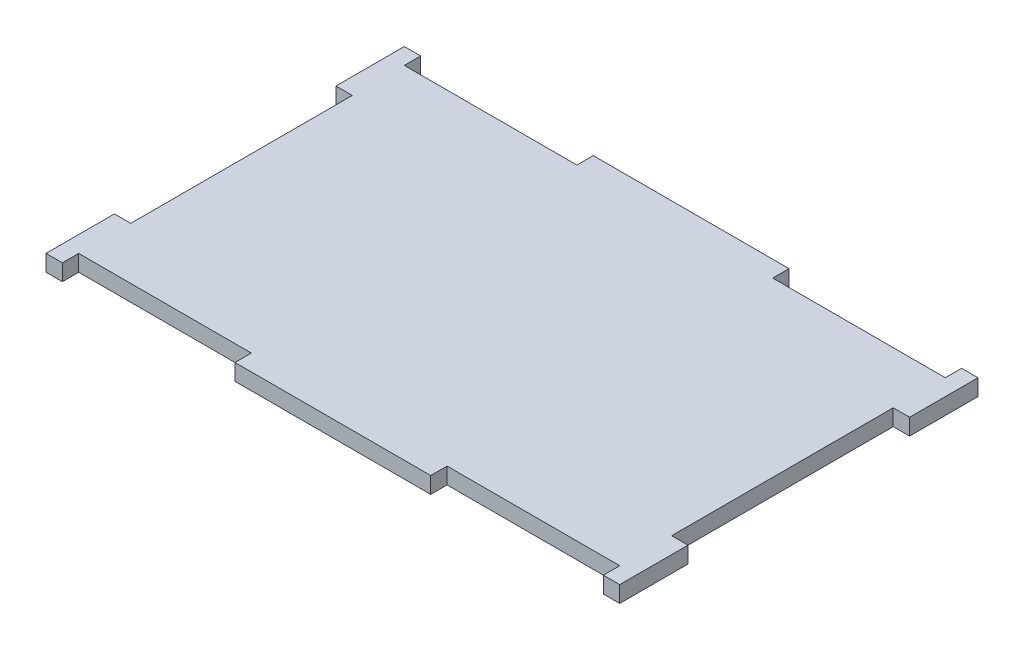
ISO-10303-21;
HEADER;
FILE_DESCRIPTION(('STEP AP214'),'2;1');
FILE_NAME('part.step','',(''),(''),'','','');
FILE_SCHEMA(('AUTOMOTIVE_DESIGN { 1 0 10303 214 1 1 1 1 }'));
ENDSEC;
DATA;
#1=APPLICATION_CONTEXT('core data for automotive mechanical design processes');
#2=APPLICATION_PROTOCOL_DEFINITION('international standard','automotive_design',2000,#1);
#3=PRODUCT_CONTEXT('',#1,'mechanical');
#4=PRODUCT('Part','Part','',(#3));
#5=PRODUCT_RELATED_PRODUCT_CATEGORY('part','',(#4));
#6=PRODUCT_DEFINITION_FORMATION('','',#4);
#7=PRODUCT_DEFINITION_CONTEXT('part definition',#1,'design');
#8=PRODUCT_DEFINITION('design','',#6,#7);
#9=PRODUCT_DEFINITION_SHAPE('','',#8);
#10=(LENGTH_UNIT() NAMED_UNIT(*) SI_UNIT(.MILLI.,.METRE.));
#11=(NAMED_UNIT(*) PLANE_ANGLE_UNIT() SI_UNIT($,.RADIAN.));
#12=(NAMED_UNIT(*) SI_UNIT($,.STERADIAN.) SOLID_ANGLE_UNIT());
#13=UNCERTAINTY_MEASURE_WITH_UNIT(LENGTH_MEASURE(1.E-05),#10,'distance_accuracy_value','');
#14=(GEOMETRIC_REPRESENTATION_CONTEXT(3) GLOBAL_UNCERTAINTY_ASSIGNED_CONTEXT((#13)) GLOBAL_UNIT_ASSIGNED_CONTEXT((#10,
#11,#12)) REPRESENTATION_CONTEXT('',''));
#15=CARTESIAN_POINT('',(0.,0.,0.));
#16=DIRECTION('',(0.,0.,1.));
#17=DIRECTION('',(1.,0.,0.));
#18=AXIS2_PLACEMENT_3D('',#15,#16,#17);
#19=CARTESIAN_POINT('',(0.,3.175,-3.175));
#20=DIRECTION('',(0.,0.,1.));
#21=DIRECTION('',(1.,0.,0.));
#22=AXIS2_PLACEMENT_3D('',#19,#20,#21);
#23=PLANE('',#22);
#24=DIRECTION('',(-1.,0.,0.));
#25=VECTOR('',#24,1.);
#26=CARTESIAN_POINT('',(0.,0.,-3.175));
#27=LINE('',#26,#25);
#28=CARTESIAN_POINT('',(108.175,0.,-3.17499999999998));
#29=VERTEX_POINT('',#28);
#30=CARTESIAN_POINT('',(74.675,0.,-3.175));
#31=VERTEX_POINT('',#30);
#32=EDGE_CURVE('E259',#29,#31,#27,.T.);
#33=ORIENTED_EDGE('',*,*,#32,.F.);
#34=DIRECTION('',(0.,-1.,0.));
#35=VECTOR('',#34,1.);
#36=CARTESIAN_POINT('',(108.175,3.175,-3.17499999999998));
#37=LINE('',#36,#35);
#38=CARTESIAN_POINT('',(108.175,3.175,-3.17499999999998));
#39=VERTEX_POINT('',#38);
#40=EDGE_CURVE('E11',#39,#29,#37,.T.);
#41=ORIENTED_EDGE('',*,*,#40,.F.);
#42=DIRECTION('',(-1.,0.,0.));
#43=VECTOR('',#42,1.);
#44=CARTESIAN_POINT('',(0.,3.175,-3.175));
#45=LINE('',#44,#43);
#46=CARTESIAN_POINT('',(74.675,3.175,-3.175));
#47=VERTEX_POINT('',#46);
#48=EDGE_CURVE('E344',#39,#47,#45,.T.);
#49=ORIENTED_EDGE('',*,*,#48,.T.);
#50=DIRECTION('',(0.,-1.,0.));
#51=VECTOR('',#50,1.);
#52=CARTESIAN_POINT('',(74.675,3.175,-3.175));
#53=LINE('',#52,#51);
#54=EDGE_CURVE('E57',#47,#31,#53,.T.);
#55=ORIENTED_EDGE('',*,*,#54,.T.);
#56=EDGE_LOOP('',(#33,#41,#49,#55));
#57=FACE_BOUND('',#56,.T.);
#58=ADVANCED_FACE('F39',(#57),#23,.T.);
#59=CARTESIAN_POINT('',(108.175,3.175,0.));
#60=DIRECTION('',(1.,0.,0.));
#61=DIRECTION('',(0.,0.,-1.));
#62=AXIS2_PLACEMENT_3D('',#59,#60,#61);
#63=PLANE('',#62);
#64=DIRECTION('',(0.,0.,1.));
#65=VECTOR('',#64,1.);
#66=CARTESIAN_POINT('',(108.175,0.,0.));
#67=LINE('',#66,#65);
#68=CARTESIAN_POINT('',(108.175,0.,0.));
#69=VERTEX_POINT('',#68);
#70=EDGE_CURVE('E262',#29,#69,#67,.T.);
#71=ORIENTED_EDGE('',*,*,#70,.T.);
#72=DIRECTION('',(0.,-1.,0.));
#73=VECTOR('',#72,1.);
#74=CARTESIAN_POINT('',(108.175,3.175,0.));
#75=LINE('',#74,#73);
#76=CARTESIAN_POINT('',(108.175,3.175,0.));
#77=VERTEX_POINT('',#76);
#78=EDGE_CURVE('E49',#77,#69,#75,.T.);
#79=ORIENTED_EDGE('',*,*,#78,.F.);
#80=DIRECTION('',(0.,0.,1.));
#81=VECTOR('',#80,1.);
#82=CARTESIAN_POINT('',(108.175,3.175,0.));
#83=LINE('',#82,#81);
#84=EDGE_CURVE('E452',#39,#77,#83,.T.);
#85=ORIENTED_EDGE('',*,*,#84,.F.);
#86=ORIENTED_EDGE('',*,*,#40,.T.);
#87=EDGE_LOOP('',(#71,#79,#85,#86));
#88=FACE_BOUND('',#87,.T.);
#89=ADVANCED_FACE('F41',(#88),#63,.F.);
#90=CARTESIAN_POINT('',(0.,3.175,0.));
#91=DIRECTION('',(0.,0.,-1.));
#92=DIRECTION('',(-1.,0.,0.));
#93=AXIS2_PLACEMENT_3D('',#90,#91,#92);
#94=PLANE('',#93);
#95=DIRECTION('',(1.,0.,0.));
#96=VECTOR('',#95,1.);
#97=CARTESIAN_POINT('',(0.,0.,0.));
#98=LINE('',#97,#96);
#99=CARTESIAN_POINT('',(111.35,0.,0.));
#100=VERTEX_POINT('',#99);
#101=EDGE_CURVE('E266',#69,#100,#98,.T.);
#102=ORIENTED_EDGE('',*,*,#101,.T.);
#103=DIRECTION('',(0.,-1.,0.));
#104=VECTOR('',#103,1.);
#105=CARTESIAN_POINT('',(111.35,3.175,0.));
#106=LINE('',#105,#104);
#107=CARTESIAN_POINT('',(111.35,3.175,0.));
#108=VERTEX_POINT('',#107);
#109=EDGE_CURVE('E418',#108,#100,#106,.T.);
#110=ORIENTED_EDGE('',*,*,#109,.F.);
#111=DIRECTION('',(1.,0.,0.));
#112=VECTOR('',#111,1.);
#113=CARTESIAN_POINT('',(0.,3.175,0.));
#114=LINE('',#113,#112);
#115=EDGE_CURVE('E429',#77,#108,#114,.T.);
#116=ORIENTED_EDGE('',*,*,#115,.F.);
#117=ORIENTED_EDGE('',*,*,#78,.T.);
#118=EDGE_LOOP('',(#102,#110,#116,#117));
#119=FACE_BOUND('',#118,.T.);
#120=ADVANCED_FACE('F427',(#119),#94,.F.);
#121=CARTESIAN_POINT('',(111.35,3.175,0.));
#122=DIRECTION('',(-1.,0.,0.));
#123=DIRECTION('',(0.,0.,1.));
#124=AXIS2_PLACEMENT_3D('',#121,#122,#123);
#125=PLANE('',#124);
#126=DIRECTION('',(0.,0.,-1.));
#127=VECTOR('',#126,1.);
#128=CARTESIAN_POINT('',(111.35,0.,0.));
#129=LINE('',#128,#127);
#130=CARTESIAN_POINT('',(111.35,0.,-13.275));
#131=VERTEX_POINT('',#130);
#132=EDGE_CURVE('E269',#100,#131,#129,.T.);
#133=ORIENTED_EDGE('',*,*,#132,.T.);
#134=DIRECTION('',(0.,-1.,0.));
#135=VECTOR('',#134,1.);
#136=CARTESIAN_POINT('',(111.35,3.175,-13.275));
#137=LINE('',#136,#135);
#138=CARTESIAN_POINT('',(111.35,3.175,-13.275));
#139=VERTEX_POINT('',#138);
#140=EDGE_CURVE('E415',#139,#131,#137,.T.);
#141=ORIENTED_EDGE('',*,*,#140,.F.);
#142=DIRECTION('',(0.,0.,-1.));
#143=VECTOR('',#142,1.);
#144=CARTESIAN_POINT('',(111.35,3.175,0.));
#145=LINE('',#144,#143);
#146=EDGE_CURVE('E442',#108,#139,#145,.T.);
#147=ORIENTED_EDGE('',*,*,#146,.F.);
#148=ORIENTED_EDGE('',*,*,#109,.T.);
#149=EDGE_LOOP('',(#133,#141,#147,#148));
#150=FACE_BOUND('',#149,.T.);
#151=ADVANCED_FACE('F439',(#150),#125,.F.);
#152=CARTESIAN_POINT('',(0.,3.175,-13.275));
#153=DIRECTION('',(0.,0.,-1.));
#154=DIRECTION('',(-1.,0.,0.));
#155=AXIS2_PLACEMENT_3D('',#152,#153,#154);
#156=PLANE('',#155);
#157=DIRECTION('',(1.,0.,0.));
#158=VECTOR('',#157,1.);
#159=CARTESIAN_POINT('',(0.,0.,-13.275));
#160=LINE('',#159,#158);
#161=CARTESIAN_POINT('',(108.175,0.,-13.275));
#162=VERTEX_POINT('',#161);
#163=EDGE_CURVE('E274',#162,#131,#160,.T.);
#164=ORIENTED_EDGE('',*,*,#163,.F.);
#165=DIRECTION('',(0.,-1.,0.));
#166=VECTOR('',#165,1.);
#167=CARTESIAN_POINT('',(108.175,3.175,-13.275));
#168=LINE('',#167,#166);
#169=CARTESIAN_POINT('',(108.175,3.175,-13.275));
#170=VERTEX_POINT('',#169);
#171=EDGE_CURVE('E412',#170,#162,#168,.T.);
#172=ORIENTED_EDGE('',*,*,#171,.F.);
#173=DIRECTION('',(1.,0.,0.));
#174=VECTOR('',#173,1.);
#175=CARTESIAN_POINT('',(0.,3.175,-13.275));
#176=LINE('',#175,#174);
#177=EDGE_CURVE('E445',#170,#139,#176,.T.);
#178=ORIENTED_EDGE('',*,*,#177,.T.);
#179=ORIENTED_EDGE('',*,*,#140,.T.);
#180=EDGE_LOOP('',(#164,#172,#178,#179));
#181=FACE_BOUND('',#180,.T.);
#182=ADVANCED_FACE('F641',(#181),#156,.T.);
#183=CARTESIAN_POINT('',(108.175,3.175,0.));
#184=DIRECTION('',(-1.,0.,0.));
#185=DIRECTION('',(0.,0.,1.));
#186=AXIS2_PLACEMENT_3D('',#183,#184,#185);
#187=PLANE('',#186);
#188=DIRECTION('',(0.,0.,-1.));
#189=VECTOR('',#188,1.);
#190=CARTESIAN_POINT('',(108.175,0.,0.));
#191=LINE('',#190,#189);
#192=CARTESIAN_POINT('',(108.175,0.,-56.275));
#193=VERTEX_POINT('',#192);
#194=EDGE_CURVE('E279',#162,#193,#191,.T.);
#195=ORIENTED_EDGE('',*,*,#194,.T.);
#196=DIRECTION('',(0.,-1.,0.));
#197=VECTOR('',#196,1.);
#198=CARTESIAN_POINT('',(108.175,3.175,-56.275));
#199=LINE('',#198,#197);
#200=CARTESIAN_POINT('',(108.175,3.175,-56.275));
#201=VERTEX_POINT('',#200);
#202=EDGE_CURVE('E408',#201,#193,#199,.T.);
#203=ORIENTED_EDGE('',*,*,#202,.F.);
#204=DIRECTION('',(0.,0.,-1.));
#205=VECTOR('',#204,1.);
#206=CARTESIAN_POINT('',(108.175,3.175,0.));
#207=LINE('',#206,#205);
#208=EDGE_CURVE('E450',#170,#201,#207,.T.);
#209=ORIENTED_EDGE('',*,*,#208,.F.);
#210=ORIENTED_EDGE('',*,*,#171,.T.);
#211=EDGE_LOOP('',(#195,#203,#209,#210));
#212=FACE_BOUND('',#211,.T.);
#213=ADVANCED_FACE('F646',(#212),#187,.F.);
#214=CARTESIAN_POINT('',(0.,3.175,-56.275));
#215=DIRECTION('',(0.,0.,-1.));
#216=DIRECTION('',(-1.,0.,0.));
#217=AXIS2_PLACEMENT_3D('',#214,#215,#216);
#218=PLANE('',#217);
#219=DIRECTION('',(1.,0.,0.));
#220=VECTOR('',#219,1.);
#221=CARTESIAN_POINT('',(0.,0.,-56.275));
#222=LINE('',#221,#220);
#223=CARTESIAN_POINT('',(111.35,0.,-56.275));
#224=VERTEX_POINT('',#223);
#225=EDGE_CURVE('E282',#193,#224,#222,.T.);
#226=ORIENTED_EDGE('',*,*,#225,.T.);
#227=DIRECTION('',(0.,-1.,0.));
#228=VECTOR('',#227,1.);
#229=CARTESIAN_POINT('',(111.35,3.175,-56.275));
#230=LINE('',#229,#228);
#231=CARTESIAN_POINT('',(111.35,3.175,-56.275));
#232=VERTEX_POINT('',#231);
#233=EDGE_CURVE('E404',#232,#224,#230,.T.);
#234=ORIENTED_EDGE('',*,*,#233,.F.);
#235=DIRECTION('',(1.,0.,0.));
#236=VECTOR('',#235,1.);
#237=CARTESIAN_POINT('',(0.,3.175,-56.275));
#238=LINE('',#237,#236);
#239=EDGE_CURVE('E457',#201,#232,#238,.T.);
#240=ORIENTED_EDGE('',*,*,#239,.F.);
#241=ORIENTED_EDGE('',*,*,#202,.T.);
#242=EDGE_LOOP('',(#226,#234,#240,#241));
#243=FACE_BOUND('',#242,.T.);
#244=ADVANCED_FACE('F651',(#243),#218,.F.);
#245=CARTESIAN_POINT('',(111.35,0.,-69.55));
#246=VERTEX_POINT('',#245);
#247=EDGE_CURVE('E275',#224,#246,#129,.T.);
#248=ORIENTED_EDGE('',*,*,#247,.T.);
#249=DIRECTION('',(0.,-1.,0.));
#250=VECTOR('',#249,1.);
#251=CARTESIAN_POINT('',(111.35,3.175,-69.55));
#252=LINE('',#251,#250);
#253=CARTESIAN_POINT('',(111.35,3.175,-69.55));
#254=VERTEX_POINT('',#253);
#255=EDGE_CURVE('E401',#254,#246,#252,.T.);
#256=ORIENTED_EDGE('',*,*,#255,.F.);
#257=EDGE_CURVE('E447',#232,#254,#145,.T.);
#258=ORIENTED_EDGE('',*,*,#257,.F.);
#259=ORIENTED_EDGE('',*,*,#233,.T.);
#260=EDGE_LOOP('',(#248,#256,#258,#259));
#261=FACE_BOUND('',#260,.T.);
#262=ADVANCED_FACE('F565',(#261),#125,.F.);
#263=CARTESIAN_POINT('',(0.,3.175,-69.55));
#264=DIRECTION('',(0.,0.,-1.));
#265=DIRECTION('',(-1.,0.,0.));
#266=AXIS2_PLACEMENT_3D('',#263,#264,#265);
#267=PLANE('',#266);
#268=DIRECTION('',(1.,0.,0.));
#269=VECTOR('',#268,1.);
#270=CARTESIAN_POINT('',(0.,0.,-69.55));
#271=LINE('',#270,#269);
#272=CARTESIAN_POINT('',(108.175,0.,-69.55));
#273=VERTEX_POINT('',#272);
#274=EDGE_CURVE('E285',#273,#246,#271,.T.);
#275=ORIENTED_EDGE('',*,*,#274,.F.);
#276=DIRECTION('',(0.,-1.,0.));
#277=VECTOR('',#276,1.);
#278=CARTESIAN_POINT('',(108.175,3.175,-69.55));
#279=LINE('',#278,#277);
#280=CARTESIAN_POINT('',(108.175,3.175,-69.55));
#281=VERTEX_POINT('',#280);
#282=EDGE_CURVE('E398',#281,#273,#279,.T.);
#283=ORIENTED_EDGE('',*,*,#282,.F.);
#284=DIRECTION('',(1.,0.,0.));
#285=VECTOR('',#284,1.);
#286=CARTESIAN_POINT('',(0.,3.175,-69.55));
#287=LINE('',#286,#285);
#288=EDGE_CURVE('E456',#281,#254,#287,.T.);
#289=ORIENTED_EDGE('',*,*,#288,.T.);
#290=ORIENTED_EDGE('',*,*,#255,.T.);
#291=EDGE_LOOP('',(#275,#283,#289,#290));
#292=FACE_BOUND('',#291,.T.);
#293=ADVANCED_FACE('F571',(#292),#267,.T.);
#294=CARTESIAN_POINT('',(108.175,3.175,0.));
#295=DIRECTION('',(-1.,0.,0.));
#296=DIRECTION('',(0.,0.,1.));
#297=AXIS2_PLACEMENT_3D('',#294,#295,#296);
#298=PLANE('',#297);
#299=DIRECTION('',(0.,0.,-1.));
#300=VECTOR('',#299,1.);
#301=CARTESIAN_POINT('',(108.175,0.,0.));
#302=LINE('',#301,#300);
#303=CARTESIAN_POINT('',(108.175,0.,-66.375));
#304=VERTEX_POINT('',#303);
#305=EDGE_CURVE('E289',#304,#273,#302,.T.);
#306=ORIENTED_EDGE('',*,*,#305,.F.);
#307=DIRECTION('',(0.,-1.,0.));
#308=VECTOR('',#307,1.);
#309=CARTESIAN_POINT('',(108.175,3.175,-66.375));
#310=LINE('',#309,#308);
#311=CARTESIAN_POINT('',(108.175,3.175,-66.375));
#312=VERTEX_POINT('',#311);
#313=EDGE_CURVE('E395',#312,#304,#310,.T.);
#314=ORIENTED_EDGE('',*,*,#313,.F.);
#315=DIRECTION('',(0.,0.,-1.));
#316=VECTOR('',#315,1.);
#317=CARTESIAN_POINT('',(108.175,3.175,0.));
#318=LINE('',#317,#316);
#319=EDGE_CURVE('E464',#312,#281,#318,.T.);
#320=ORIENTED_EDGE('',*,*,#319,.T.);
#321=ORIENTED_EDGE('',*,*,#282,.T.);
#322=EDGE_LOOP('',(#306,#314,#320,#321));
#323=FACE_BOUND('',#322,.T.);
#324=ADVANCED_FACE('F574',(#323),#298,.T.);
#325=CARTESIAN_POINT('',(0.,3.175,-66.375));
#326=DIRECTION('',(0.,0.,1.));
#327=DIRECTION('',(1.,0.,0.));
#328=AXIS2_PLACEMENT_3D('',#325,#326,#327);
#329=PLANE('',#328);
#330=DIRECTION('',(-1.,0.,0.));
#331=VECTOR('',#330,1.);
#332=CARTESIAN_POINT('',(0.,0.,-66.375));
#333=LINE('',#332,#331);
#334=CARTESIAN_POINT('',(74.6750000000001,0.,-66.375));
#335=VERTEX_POINT('',#334);
#336=EDGE_CURVE('E294',#304,#335,#333,.T.);
#337=ORIENTED_EDGE('',*,*,#336,.T.);
#338=DIRECTION('',(0.,-1.,0.));
#339=VECTOR('',#338,1.);
#340=CARTESIAN_POINT('',(74.6750000000001,3.175,-66.375));
#341=LINE('',#340,#339);
#342=CARTESIAN_POINT('',(74.6750000000001,3.175,-66.375));
#343=VERTEX_POINT('',#342);
#344=EDGE_CURVE('E391',#343,#335,#341,.T.);
#345=ORIENTED_EDGE('',*,*,#344,.F.);
#346=DIRECTION('',(-1.,0.,0.));
#347=VECTOR('',#346,1.);
#348=CARTESIAN_POINT('',(0.,3.175,-66.375));
#349=LINE('',#348,#347);
#350=EDGE_CURVE('E476',#312,#343,#349,.T.);
#351=ORIENTED_EDGE('',*,*,#350,.F.);
#352=ORIENTED_EDGE('',*,*,#313,.T.);
#353=EDGE_LOOP('',(#337,#345,#351,#352));
#354=FACE_BOUND('',#353,.T.);
#355=ADVANCED_FACE('F578',(#354),#329,.F.);
#356=CARTESIAN_POINT('',(74.6750000000001,3.175,0.));
#357=DIRECTION('',(-1.,0.,0.));
#358=DIRECTION('',(0.,0.,1.));
#359=AXIS2_PLACEMENT_3D('',#356,#357,#358);
#360=PLANE('',#359);
#361=DIRECTION('',(0.,0.,-1.));
#362=VECTOR('',#361,1.);
#363=CARTESIAN_POINT('',(74.6750000000001,0.,0.));
#364=LINE('',#363,#362);
#365=CARTESIAN_POINT('',(74.6750000000001,0.,-69.55));
#366=VERTEX_POINT('',#365);
#367=EDGE_CURVE('E297',#335,#366,#364,.T.);
#368=ORIENTED_EDGE('',*,*,#367,.T.);
#369=DIRECTION('',(0.,-1.,0.));
#370=VECTOR('',#369,1.);
#371=CARTESIAN_POINT('',(74.6750000000001,3.175,-69.55));
#372=LINE('',#371,#370);
#373=CARTESIAN_POINT('',(74.6750000000001,3.175,-69.55));
#374=VERTEX_POINT('',#373);
#375=EDGE_CURVE('E388',#374,#366,#372,.T.);
#376=ORIENTED_EDGE('',*,*,#375,.F.);
#377=DIRECTION('',(0.,0.,-1.));
#378=VECTOR('',#377,1.);
#379=CARTESIAN_POINT('',(74.6750000000001,3.175,0.));
#380=LINE('',#379,#378);
#381=EDGE_CURVE('E479',#343,#374,#380,.T.);
#382=ORIENTED_EDGE('',*,*,#381,.F.);
#383=ORIENTED_EDGE('',*,*,#344,.T.);
#384=EDGE_LOOP('',(#368,#376,#382,#383));
#385=FACE_BOUND('',#384,.T.);
#386=ADVANCED_FACE('F584',(#385),#360,.F.);
#387=CARTESIAN_POINT('',(0.,3.175,-69.55));
#388=DIRECTION('',(0.,0.,-1.));
#389=DIRECTION('',(-1.,0.,0.));
#390=AXIS2_PLACEMENT_3D('',#387,#388,#389);
#391=PLANE('',#390);
#392=DIRECTION('',(1.,0.,0.));
#393=VECTOR('',#392,1.);
#394=CARTESIAN_POINT('',(0.,0.,-69.55));
#395=LINE('',#394,#393);
#396=CARTESIAN_POINT('',(36.6750000000001,0.,-69.55));
#397=VERTEX_POINT('',#396);
#398=EDGE_CURVE('E302',#397,#366,#395,.T.);
#399=ORIENTED_EDGE('',*,*,#398,.F.);
#400=DIRECTION('',(0.,-1.,0.));
#401=VECTOR('',#400,1.);
#402=CARTESIAN_POINT('',(36.6750000000001,3.175,-69.55));
#403=LINE('',#402,#401);
#404=CARTESIAN_POINT('',(36.6750000000001,3.175,-69.55));
#405=VERTEX_POINT('',#404);
#406=EDGE_CURVE('E385',#405,#397,#403,.T.);
#407=ORIENTED_EDGE('',*,*,#406,.F.);
#408=DIRECTION('',(1.,0.,0.));
#409=VECTOR('',#408,1.);
#410=CARTESIAN_POINT('',(0.,3.175,-69.55));
#411=LINE('',#410,#409);
#412=EDGE_CURVE('E483',#405,#374,#411,.T.);
#413=ORIENTED_EDGE('',*,*,#412,.T.);
#414=ORIENTED_EDGE('',*,*,#375,.T.);
#415=EDGE_LOOP('',(#399,#407,#413,#414));
#416=FACE_BOUND('',#415,.T.);
#417=ADVANCED_FACE('F588',(#416),#391,.T.);
#418=CARTESIAN_POINT('',(36.6750000000001,3.175,0.));
#419=DIRECTION('',(-1.,0.,0.));
#420=DIRECTION('',(0.,0.,1.));
#421=AXIS2_PLACEMENT_3D('',#418,#419,#420);
#422=PLANE('',#421);
#423=DIRECTION('',(0.,0.,-1.));
#424=VECTOR('',#423,1.);
#425=CARTESIAN_POINT('',(36.6750000000001,0.,0.));
#426=LINE('',#425,#424);
#427=CARTESIAN_POINT('',(36.6750000000001,0.,-66.375));
#428=VERTEX_POINT('',#427);
#429=EDGE_CURVE('E306',#428,#397,#426,.T.);
#430=ORIENTED_EDGE('',*,*,#429,.F.);
#431=DIRECTION('',(0.,-1.,0.));
#432=VECTOR('',#431,1.);
#433=CARTESIAN_POINT('',(36.6750000000001,3.175,-66.375));
#434=LINE('',#433,#432);
#435=CARTESIAN_POINT('',(36.6750000000001,3.175,-66.375));
#436=VERTEX_POINT('',#435);
#437=EDGE_CURVE('E382',#436,#428,#434,.T.);
#438=ORIENTED_EDGE('',*,*,#437,.F.);
#439=DIRECTION('',(0.,0.,-1.));
#440=VECTOR('',#439,1.);
#441=CARTESIAN_POINT('',(36.6750000000001,3.175,0.));
#442=LINE('',#441,#440);
#443=EDGE_CURVE('E487',#436,#405,#442,.T.);
#444=ORIENTED_EDGE('',*,*,#443,.T.);
#445=ORIENTED_EDGE('',*,*,#406,.T.);
#446=EDGE_LOOP('',(#430,#438,#444,#445));
#447=FACE_BOUND('',#446,.T.);
#448=ADVANCED_FACE('F591',(#447),#422,.T.);
#449=CARTESIAN_POINT('',(3.17499999999998,0.,-66.375));
#450=VERTEX_POINT('',#449);
#451=EDGE_CURVE('E298',#428,#450,#333,.T.);
#452=ORIENTED_EDGE('',*,*,#451,.T.);
#453=DIRECTION('',(0.,-1.,0.));
#454=VECTOR('',#453,1.);
#455=CARTESIAN_POINT('',(3.17499999999998,3.175,-66.375));
#456=LINE('',#455,#454);
#457=CARTESIAN_POINT('',(3.17499999999998,3.175,-66.375));
#458=VERTEX_POINT('',#457);
#459=EDGE_CURVE('E378',#458,#450,#456,.T.);
#460=ORIENTED_EDGE('',*,*,#459,.F.);
#461=EDGE_CURVE('E480',#436,#458,#349,.T.);
#462=ORIENTED_EDGE('',*,*,#461,.F.);
#463=ORIENTED_EDGE('',*,*,#437,.T.);
#464=EDGE_LOOP('',(#452,#460,#462,#463));
#465=FACE_BOUND('',#464,.T.);
#466=ADVANCED_FACE('F599',(#465),#329,.F.);
#467=CARTESIAN_POINT('',(3.17499999999998,3.175,0.));
#468=DIRECTION('',(-1.,0.,0.));
#469=DIRECTION('',(0.,0.,1.));
#470=AXIS2_PLACEMENT_3D('',#467,#468,#469);
#471=PLANE('',#470);
#472=DIRECTION('',(0.,0.,-1.));
#473=VECTOR('',#472,1.);
#474=CARTESIAN_POINT('',(3.17499999999998,0.,0.));
#475=LINE('',#474,#473);
#476=CARTESIAN_POINT('',(3.17499999999998,0.,-69.55));
#477=VERTEX_POINT('',#476);
#478=EDGE_CURVE('E310',#450,#477,#475,.T.);
#479=ORIENTED_EDGE('',*,*,#478,.T.);
#480=DIRECTION('',(0.,-1.,0.));
#481=VECTOR('',#480,1.);
#482=CARTESIAN_POINT('',(3.17499999999998,3.175,-69.55));
#483=LINE('',#482,#481);
#484=CARTESIAN_POINT('',(3.17499999999998,3.175,-69.55));
#485=VERTEX_POINT('',#484);
#486=EDGE_CURVE('E375',#485,#477,#483,.T.);
#487=ORIENTED_EDGE('',*,*,#486,.F.);
#488=DIRECTION('',(0.,0.,-1.));
#489=VECTOR('',#488,1.);
#490=CARTESIAN_POINT('',(3.17499999999998,3.175,0.));
#491=LINE('',#490,#489);
#492=EDGE_CURVE('E491',#458,#485,#491,.T.);
#493=ORIENTED_EDGE('',*,*,#492,.F.);
#494=ORIENTED_EDGE('',*,*,#459,.T.);
#495=EDGE_LOOP('',(#479,#487,#493,#494));
#496=FACE_BOUND('',#495,.T.);
#497=ADVANCED_FACE('F603',(#496),#471,.F.);
#498=CARTESIAN_POINT('',(0.,0.,-69.55));
#499=VERTEX_POINT('',#498);
#500=EDGE_CURVE('E290',#499,#477,#271,.T.);
#501=ORIENTED_EDGE('',*,*,#500,.F.);
#502=DIRECTION('',(0.,-1.,0.));
#503=VECTOR('',#502,1.);
#504=CARTESIAN_POINT('',(0.,3.175,-69.55));
#505=LINE('',#504,#503);
#506=CARTESIAN_POINT('',(0.,3.175,-69.55));
#507=VERTEX_POINT('',#506);
#508=EDGE_CURVE('E372',#507,#499,#505,.T.);
#509=ORIENTED_EDGE('',*,*,#508,.F.);
#510=EDGE_CURVE('E466',#507,#485,#287,.T.);
#511=ORIENTED_EDGE('',*,*,#510,.T.);
#512=ORIENTED_EDGE('',*,*,#486,.T.);
#513=EDGE_LOOP('',(#501,#509,#511,#512));
#514=FACE_BOUND('',#513,.T.);
#515=ADVANCED_FACE('F607',(#514),#267,.T.);
#516=CARTESIAN_POINT('',(0.,3.175,0.));
#517=DIRECTION('',(-1.,0.,0.));
#518=DIRECTION('',(0.,0.,1.));
#519=AXIS2_PLACEMENT_3D('',#516,#517,#518);
#520=PLANE('',#519);
#521=DIRECTION('',(0.,0.,-1.));
#522=VECTOR('',#521,1.);
#523=CARTESIAN_POINT('',(0.,0.,0.));
#524=LINE('',#523,#522);
#525=CARTESIAN_POINT('',(0.,0.,-56.275));
#526=VERTEX_POINT('',#525);
#527=EDGE_CURVE('E314',#526,#499,#524,.T.);
#528=ORIENTED_EDGE('',*,*,#527,.F.);
#529=DIRECTION('',(0.,-1.,0.));
#530=VECTOR('',#529,1.);
#531=CARTESIAN_POINT('',(0.,3.175,-56.275));
#532=LINE('',#531,#530);
#533=CARTESIAN_POINT('',(0.,3.175,-56.275));
#534=VERTEX_POINT('',#533);
#535=EDGE_CURVE('E369',#534,#526,#532,.T.);
#536=ORIENTED_EDGE('',*,*,#535,.F.);
#537=DIRECTION('',(0.,0.,-1.));
#538=VECTOR('',#537,1.);
#539=CARTESIAN_POINT('',(0.,3.175,0.));
#540=LINE('',#539,#538);
#541=EDGE_CURVE('E494',#534,#507,#540,.T.);
#542=ORIENTED_EDGE('',*,*,#541,.T.);
#543=ORIENTED_EDGE('',*,*,#508,.T.);
#544=EDGE_LOOP('',(#528,#536,#542,#543));
#545=FACE_BOUND('',#544,.T.);
#546=ADVANCED_FACE('F613',(#545),#520,.T.);
#547=CARTESIAN_POINT('',(0.,3.175,-56.275));
#548=DIRECTION('',(0.,0.,1.));
#549=DIRECTION('',(1.,0.,0.));
#550=AXIS2_PLACEMENT_3D('',#547,#548,#549);
#551=PLANE('',#550);
#552=DIRECTION('',(-1.,0.,0.));
#553=VECTOR('',#552,1.);
#554=CARTESIAN_POINT('',(0.,0.,-56.275));
#555=LINE('',#554,#553);
#556=CARTESIAN_POINT('',(3.175,0.,-56.275));
#557=VERTEX_POINT('',#556);
#558=EDGE_CURVE('E318',#557,#526,#555,.T.);
#559=ORIENTED_EDGE('',*,*,#558,.F.);
#560=DIRECTION('',(0.,-1.,0.));
#561=VECTOR('',#560,1.);
#562=CARTESIAN_POINT('',(3.175,3.175,-56.275));
#563=LINE('',#562,#561);
#564=CARTESIAN_POINT('',(3.175,3.175,-56.275));
#565=VERTEX_POINT('',#564);
#566=EDGE_CURVE('E366',#565,#557,#563,.T.);
#567=ORIENTED_EDGE('',*,*,#566,.F.);
#568=DIRECTION('',(-1.,0.,0.));
#569=VECTOR('',#568,1.);
#570=CARTESIAN_POINT('',(0.,3.175,-56.275));
#571=LINE('',#570,#569);
#572=EDGE_CURVE('E498',#565,#534,#571,.T.);
#573=ORIENTED_EDGE('',*,*,#572,.T.);
#574=ORIENTED_EDGE('',*,*,#535,.T.);
#575=EDGE_LOOP('',(#559,#567,#573,#574));
#576=FACE_BOUND('',#575,.T.);
#577=ADVANCED_FACE('F616',(#576),#551,.T.);
#578=CARTESIAN_POINT('',(3.175,3.175,0.));
#579=DIRECTION('',(-1.,0.,0.));
#580=DIRECTION('',(0.,0.,1.));
#581=AXIS2_PLACEMENT_3D('',#578,#579,#580);
#582=PLANE('',#581);
#583=DIRECTION('',(0.,0.,-1.));
#584=VECTOR('',#583,1.);
#585=CARTESIAN_POINT('',(3.175,0.,0.));
#586=LINE('',#585,#584);
#587=CARTESIAN_POINT('',(3.175,0.,-13.275));
#588=VERTEX_POINT('',#587);
#589=EDGE_CURVE('E323',#588,#557,#586,.T.);
#590=ORIENTED_EDGE('',*,*,#589,.F.);
#591=DIRECTION('',(0.,-1.,0.));
#592=VECTOR('',#591,1.);
#593=CARTESIAN_POINT('',(3.175,3.175,-13.275));
#594=LINE('',#593,#592);
#595=CARTESIAN_POINT('',(3.175,3.175,-13.275));
#596=VERTEX_POINT('',#595);
#597=EDGE_CURVE('E363',#596,#588,#594,.T.);
#598=ORIENTED_EDGE('',*,*,#597,.F.);
#599=DIRECTION('',(0.,0.,-1.));
#600=VECTOR('',#599,1.);
#601=CARTESIAN_POINT('',(3.175,3.175,0.));
#602=LINE('',#601,#600);
#603=EDGE_CURVE('E503',#596,#565,#602,.T.);
#604=ORIENTED_EDGE('',*,*,#603,.T.);
#605=ORIENTED_EDGE('',*,*,#566,.T.);
#606=EDGE_LOOP('',(#590,#598,#604,#605));
#607=FACE_BOUND('',#606,.T.);
#608=ADVANCED_FACE('F620',(#607),#582,.T.);
#609=CARTESIAN_POINT('',(0.,3.175,-13.275));
#610=DIRECTION('',(0.,0.,1.));
#611=DIRECTION('',(1.,0.,0.));
#612=AXIS2_PLACEMENT_3D('',#609,#610,#611);
#613=PLANE('',#612);
#614=DIRECTION('',(-1.,0.,0.));
#615=VECTOR('',#614,1.);
#616=CARTESIAN_POINT('',(0.,0.,-13.275));
#617=LINE('',#616,#615);
#618=CARTESIAN_POINT('',(0.,0.,-13.275));
#619=VERTEX_POINT('',#618);
#620=EDGE_CURVE('E327',#588,#619,#617,.T.);
#621=ORIENTED_EDGE('',*,*,#620,.T.);
#622=DIRECTION('',(0.,-1.,0.));
#623=VECTOR('',#622,1.);
#624=CARTESIAN_POINT('',(0.,3.175,-13.275));
#625=LINE('',#624,#623);
#626=CARTESIAN_POINT('',(0.,3.175,-13.275));
#627=VERTEX_POINT('',#626);
#628=EDGE_CURVE('E360',#627,#619,#625,.T.);
#629=ORIENTED_EDGE('',*,*,#628,.F.);
#630=DIRECTION('',(-1.,0.,0.));
#631=VECTOR('',#630,1.);
#632=CARTESIAN_POINT('',(0.,3.175,-13.275));
#633=LINE('',#632,#631);
#634=EDGE_CURVE('E507',#596,#627,#633,.T.);
#635=ORIENTED_EDGE('',*,*,#634,.F.);
#636=ORIENTED_EDGE('',*,*,#597,.T.);
#637=EDGE_LOOP('',(#621,#629,#635,#636));
#638=FACE_BOUND('',#637,.T.);
#639=ADVANCED_FACE('F625',(#638),#613,.F.);
#640=CARTESIAN_POINT('',(0.,0.,0.));
#641=VERTEX_POINT('',#640);
#642=EDGE_CURVE('E319',#641,#619,#524,.T.);
#643=ORIENTED_EDGE('',*,*,#642,.F.);
#644=DIRECTION('',(0.,-1.,0.));
#645=VECTOR('',#644,1.);
#646=CARTESIAN_POINT('',(0.,3.175,0.));
#647=LINE('',#646,#645);
#648=CARTESIAN_POINT('',(0.,3.175,0.));
#649=VERTEX_POINT('',#648);
#650=EDGE_CURVE('E357',#649,#641,#647,.T.);
#651=ORIENTED_EDGE('',*,*,#650,.F.);
#652=EDGE_CURVE('E499',#649,#627,#540,.T.);
#653=ORIENTED_EDGE('',*,*,#652,.T.);
#654=ORIENTED_EDGE('',*,*,#628,.T.);
#655=EDGE_LOOP('',(#643,#651,#653,#654));
#656=FACE_BOUND('',#655,.T.);
#657=ADVANCED_FACE('F628',(#656),#520,.T.);
#658=CARTESIAN_POINT('',(3.17499999999997,0.,0.));
#659=VERTEX_POINT('',#658);
#660=EDGE_CURVE('E270',#641,#659,#98,.T.);
#661=ORIENTED_EDGE('',*,*,#660,.T.);
#662=DIRECTION('',(0.,-1.,0.));
#663=VECTOR('',#662,1.);
#664=CARTESIAN_POINT('',(3.17499999999997,3.175,0.));
#665=LINE('',#664,#663);
#666=CARTESIAN_POINT('',(3.17499999999997,3.175,0.));
#667=VERTEX_POINT('',#666);
#668=EDGE_CURVE('E354',#667,#659,#665,.T.);
#669=ORIENTED_EDGE('',*,*,#668,.F.);
#670=EDGE_CURVE('E454',#649,#667,#114,.T.);
#671=ORIENTED_EDGE('',*,*,#670,.F.);
#672=ORIENTED_EDGE('',*,*,#650,.T.);
#673=EDGE_LOOP('',(#661,#669,#671,#672));
#674=FACE_BOUND('',#673,.T.);
#675=ADVANCED_FACE('F549',(#674),#94,.F.);
#676=CARTESIAN_POINT('',(3.17499999999997,3.175,0.));
#677=DIRECTION('',(1.,0.,0.));
#678=DIRECTION('',(0.,0.,-1.));
#679=AXIS2_PLACEMENT_3D('',#676,#677,#678);
#680=PLANE('',#679);
#681=DIRECTION('',(0.,0.,1.));
#682=VECTOR('',#681,1.);
#683=CARTESIAN_POINT('',(3.17499999999997,0.,0.));
#684=LINE('',#683,#682);
#685=CARTESIAN_POINT('',(3.17499999999997,0.,-3.175));
#686=VERTEX_POINT('',#685);
#687=EDGE_CURVE('E331',#686,#659,#684,.T.);
#688=ORIENTED_EDGE('',*,*,#687,.F.);
#689=DIRECTION('',(0.,-1.,0.));
#690=VECTOR('',#689,1.);
#691=CARTESIAN_POINT('',(3.17499999999997,3.175,-3.175));
#692=LINE('',#691,#690);
#693=CARTESIAN_POINT('',(3.17499999999997,3.175,-3.175));
#694=VERTEX_POINT('',#693);
#695=EDGE_CURVE('E351',#694,#686,#692,.T.);
#696=ORIENTED_EDGE('',*,*,#695,.F.);
#697=DIRECTION('',(0.,0.,1.));
#698=VECTOR('',#697,1.);
#699=CARTESIAN_POINT('',(3.17499999999997,3.175,0.));
#700=LINE('',#699,#698);
#701=EDGE_CURVE('E509',#694,#667,#700,.T.);
#702=ORIENTED_EDGE('',*,*,#701,.T.);
#703=ORIENTED_EDGE('',*,*,#668,.T.);
#704=EDGE_LOOP('',(#688,#696,#702,#703));
#705=FACE_BOUND('',#704,.T.);
#706=ADVANCED_FACE('F543',(#705),#680,.T.);
#707=CARTESIAN_POINT('',(36.675,0.,-3.175));
#708=VERTEX_POINT('',#707);
#709=EDGE_CURVE('E263',#708,#686,#27,.T.);
#710=ORIENTED_EDGE('',*,*,#709,.F.);
#711=DIRECTION('',(0.,-1.,0.));
#712=VECTOR('',#711,1.);
#713=CARTESIAN_POINT('',(36.675,3.175,-3.175));
#714=LINE('',#713,#712);
#715=CARTESIAN_POINT('',(36.675,3.175,-3.175));
#716=VERTEX_POINT('',#715);
#717=EDGE_CURVE('E249',#716,#708,#714,.T.);
#718=ORIENTED_EDGE('',*,*,#717,.F.);
#719=EDGE_CURVE('E237',#716,#694,#45,.T.);
#720=ORIENTED_EDGE('',*,*,#719,.T.);
#721=ORIENTED_EDGE('',*,*,#695,.T.);
#722=EDGE_LOOP('',(#710,#718,#720,#721));
#723=FACE_BOUND('',#722,.T.);
#724=ADVANCED_FACE('F536',(#723),#23,.T.);
#725=CARTESIAN_POINT('',(36.675,3.175,0.));
#726=DIRECTION('',(1.,0.,0.));
#727=DIRECTION('',(0.,0.,-1.));
#728=AXIS2_PLACEMENT_3D('',#725,#726,#727);
#729=PLANE('',#728);
#730=DIRECTION('',(0.,0.,1.));
#731=VECTOR('',#730,1.);
#732=CARTESIAN_POINT('',(36.675,0.,0.));
#733=LINE('',#732,#731);
#734=CARTESIAN_POINT('',(36.675,0.,0.));
#735=VERTEX_POINT('',#734);
#736=EDGE_CURVE('E245',#708,#735,#733,.T.);
#737=ORIENTED_EDGE('',*,*,#736,.T.);
#738=DIRECTION('',(0.,-1.,0.));
#739=VECTOR('',#738,1.);
#740=CARTESIAN_POINT('',(36.675,3.175,0.));
#741=LINE('',#740,#739);
#742=CARTESIAN_POINT('',(36.675,3.175,0.));
#743=VERTEX_POINT('',#742);
#744=EDGE_CURVE('E242',#743,#735,#741,.T.);
#745=ORIENTED_EDGE('',*,*,#744,.F.);
#746=DIRECTION('',(0.,0.,1.));
#747=VECTOR('',#746,1.);
#748=CARTESIAN_POINT('',(36.675,3.175,0.));
#749=LINE('',#748,#747);
#750=EDGE_CURVE('E228',#716,#743,#749,.T.);
#751=ORIENTED_EDGE('',*,*,#750,.F.);
#752=ORIENTED_EDGE('',*,*,#717,.T.);
#753=EDGE_LOOP('',(#737,#745,#751,#752));
#754=FACE_BOUND('',#753,.T.);
#755=ADVANCED_FACE('F243',(#754),#729,.F.);
#756=CARTESIAN_POINT('',(0.,3.175,0.));
#757=DIRECTION('',(0.,0.,-1.));
#758=DIRECTION('',(-1.,0.,0.));
#759=AXIS2_PLACEMENT_3D('',#756,#757,#758);
#760=PLANE('',#759);
#761=DIRECTION('',(1.,0.,0.));
#762=VECTOR('',#761,1.);
#763=CARTESIAN_POINT('',(0.,0.,0.));
#764=LINE('',#763,#762);
#765=CARTESIAN_POINT('',(74.675,0.,0.));
#766=VERTEX_POINT('',#765);
#767=EDGE_CURVE('E337',#735,#766,#764,.T.);
#768=ORIENTED_EDGE('',*,*,#767,.T.);
#769=DIRECTION('',(0.,-1.,0.));
#770=VECTOR('',#769,1.);
#771=CARTESIAN_POINT('',(74.675,3.175,0.));
#772=LINE('',#771,#770);
#773=CARTESIAN_POINT('',(74.675,3.175,0.));
#774=VERTEX_POINT('',#773);
#775=EDGE_CURVE('E143',#774,#766,#772,.T.);
#776=ORIENTED_EDGE('',*,*,#775,.F.);
#777=DIRECTION('',(1.,0.,0.));
#778=VECTOR('',#777,1.);
#779=CARTESIAN_POINT('',(0.,3.175,0.));
#780=LINE('',#779,#778);
#781=EDGE_CURVE('E234',#743,#774,#780,.T.);
#782=ORIENTED_EDGE('',*,*,#781,.F.);
#783=ORIENTED_EDGE('',*,*,#744,.T.);
#784=EDGE_LOOP('',(#768,#776,#782,#783));
#785=FACE_BOUND('',#784,.T.);
#786=ADVANCED_FACE('F251',(#785),#760,.F.);
#787=CARTESIAN_POINT('',(74.675,3.175,0.));
#788=DIRECTION('',(1.,0.,0.));
#789=DIRECTION('',(0.,0.,-1.));
#790=AXIS2_PLACEMENT_3D('',#787,#788,#789);
#791=PLANE('',#790);
#792=DIRECTION('',(0.,0.,1.));
#793=VECTOR('',#792,1.);
#794=CARTESIAN_POINT('',(74.675,0.,0.));
#795=LINE('',#794,#793);
#796=EDGE_CURVE('E340',#31,#766,#795,.T.);
#797=ORIENTED_EDGE('',*,*,#796,.F.);
#798=ORIENTED_EDGE('',*,*,#54,.F.);
#799=DIRECTION('',(0.,0.,1.));
#800=VECTOR('',#799,1.);
#801=CARTESIAN_POINT('',(74.675,3.175,0.));
#802=LINE('',#801,#800);
#803=EDGE_CURVE('E253',#47,#774,#802,.T.);
#804=ORIENTED_EDGE('',*,*,#803,.T.);
#805=ORIENTED_EDGE('',*,*,#775,.T.);
#806=EDGE_LOOP('',(#797,#798,#804,#805));
#807=FACE_BOUND('',#806,.T.);
#808=ADVANCED_FACE('F524',(#807),#791,.T.);
#809=CARTESIAN_POINT('',(0.,3.175,0.));
#810=DIRECTION('',(0.,1.,0.));
#811=DIRECTION('',(0.,0.,1.));
#812=AXIS2_PLACEMENT_3D('',#809,#810,#811);
#813=PLANE('',#812);
#814=ORIENTED_EDGE('',*,*,#48,.F.);
#815=ORIENTED_EDGE('',*,*,#84,.T.);
#816=ORIENTED_EDGE('',*,*,#115,.T.);
#817=ORIENTED_EDGE('',*,*,#146,.T.);
#818=ORIENTED_EDGE('',*,*,#177,.F.);
#819=ORIENTED_EDGE('',*,*,#208,.T.);
#820=ORIENTED_EDGE('',*,*,#239,.T.);
#821=ORIENTED_EDGE('',*,*,#257,.T.);
#822=ORIENTED_EDGE('',*,*,#288,.F.);
#823=ORIENTED_EDGE('',*,*,#319,.F.);
#824=ORIENTED_EDGE('',*,*,#350,.T.);
#825=ORIENTED_EDGE('',*,*,#381,.T.);
#826=ORIENTED_EDGE('',*,*,#412,.F.);
#827=ORIENTED_EDGE('',*,*,#443,.F.);
#828=ORIENTED_EDGE('',*,*,#461,.T.);
#829=ORIENTED_EDGE('',*,*,#492,.T.);
#830=ORIENTED_EDGE('',*,*,#510,.F.);
#831=ORIENTED_EDGE('',*,*,#541,.F.);
#832=ORIENTED_EDGE('',*,*,#572,.F.);
#833=ORIENTED_EDGE('',*,*,#603,.F.);
#834=ORIENTED_EDGE('',*,*,#634,.T.);
#835=ORIENTED_EDGE('',*,*,#652,.F.);
#836=ORIENTED_EDGE('',*,*,#670,.T.);
#837=ORIENTED_EDGE('',*,*,#701,.F.);
#838=ORIENTED_EDGE('',*,*,#719,.F.);
#839=ORIENTED_EDGE('',*,*,#750,.T.);
#840=ORIENTED_EDGE('',*,*,#781,.T.);
#841=ORIENTED_EDGE('',*,*,#803,.F.);
#842=EDGE_LOOP('',(#814,#815,#816,#817,#818,#819,#820,#821,#822,#823,#824,#825,#826,#827,#828,
#829,#830,#831,#832,#833,#834,#835,#836,#837,#838,#839,#840,#841));
#843=FACE_BOUND('',#842,.T.);
#844=ADVANCED_FACE('F231',(#843),#813,.T.);
#845=CARTESIAN_POINT('',(0.,0.,0.));
#846=DIRECTION('',(0.,1.,0.));
#847=DIRECTION('',(0.,0.,1.));
#848=AXIS2_PLACEMENT_3D('',#845,#846,#847);
#849=PLANE('',#848);
#850=ORIENTED_EDGE('',*,*,#32,.T.);
#851=ORIENTED_EDGE('',*,*,#796,.T.);
#852=ORIENTED_EDGE('',*,*,#767,.F.);
#853=ORIENTED_EDGE('',*,*,#736,.F.);
#854=ORIENTED_EDGE('',*,*,#709,.T.);
#855=ORIENTED_EDGE('',*,*,#687,.T.);
#856=ORIENTED_EDGE('',*,*,#660,.F.);
#857=ORIENTED_EDGE('',*,*,#642,.T.);
#858=ORIENTED_EDGE('',*,*,#620,.F.);
#859=ORIENTED_EDGE('',*,*,#589,.T.);
#860=ORIENTED_EDGE('',*,*,#558,.T.);
#861=ORIENTED_EDGE('',*,*,#527,.T.);
#862=ORIENTED_EDGE('',*,*,#500,.T.);
#863=ORIENTED_EDGE('',*,*,#478,.F.);
#864=ORIENTED_EDGE('',*,*,#451,.F.);
#865=ORIENTED_EDGE('',*,*,#429,.T.);
#866=ORIENTED_EDGE('',*,*,#398,.T.);
#867=ORIENTED_EDGE('',*,*,#367,.F.);
#868=ORIENTED_EDGE('',*,*,#336,.F.);
#869=ORIENTED_EDGE('',*,*,#305,.T.);
#870=ORIENTED_EDGE('',*,*,#274,.T.);
#871=ORIENTED_EDGE('',*,*,#247,.F.);
#872=ORIENTED_EDGE('',*,*,#225,.F.);
#873=ORIENTED_EDGE('',*,*,#194,.F.);
#874=ORIENTED_EDGE('',*,*,#163,.T.);
#875=ORIENTED_EDGE('',*,*,#132,.F.);
#876=ORIENTED_EDGE('',*,*,#101,.F.);
#877=ORIENTED_EDGE('',*,*,#70,.F.);
#878=EDGE_LOOP('',(#850,#851,#852,#853,#854,#855,#856,#857,#858,#859,#860,#861,#862,#863,#864,
#865,#866,#867,#868,#869,#870,#871,#872,#873,#874,#875,#876,#877));
#879=FACE_BOUND('',#878,.T.);
#880=ADVANCED_FACE('F434',(#879),#849,.F.);
#881=CLOSED_SHELL('',(#58,#89,#120,#151,#182,#213,#244,#262,#293,#324,#355,#386,#417,#448,#466,
#497,#515,#546,#577,#608,#639,#657,#675,#706,#724,#755,#786,#808,#844,#880));
#882=MANIFOLD_SOLID_BREP('B2',#881);
#883=ADVANCED_BREP_SHAPE_REPRESENTATION('',(#18,#882),#14);
#884=SHAPE_DEFINITION_REPRESENTATION(#9,#883);
ENDSEC;
END-ISO-10303-21;
